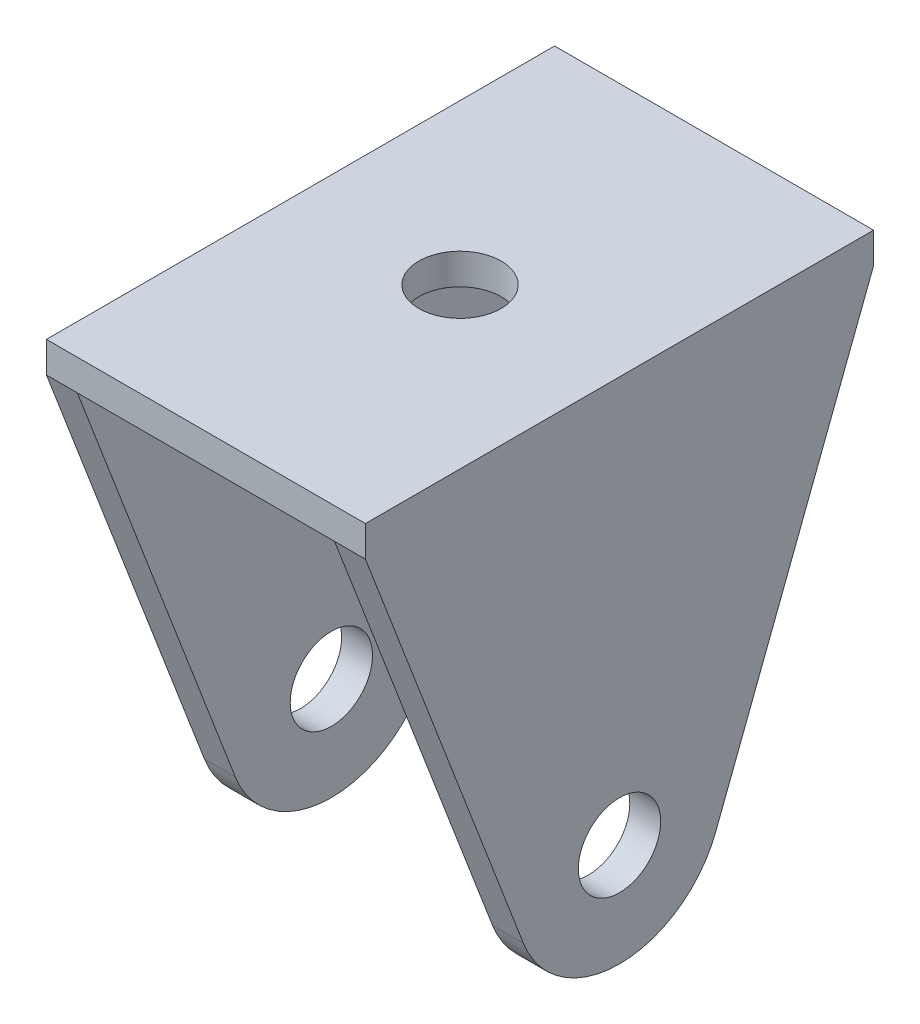
ISO-10303-21;
HEADER;
FILE_DESCRIPTION(('STEP AP214'),'2;1');
FILE_NAME('part.step','',(''),(''),'','','');
FILE_SCHEMA(('AUTOMOTIVE_DESIGN { 1 0 10303 214 1 1 1 1 }'));
ENDSEC;
DATA;
#1=APPLICATION_CONTEXT('core data for automotive mechanical design processes');
#2=APPLICATION_PROTOCOL_DEFINITION('international standard','automotive_design',2000,#1);
#3=PRODUCT_CONTEXT('',#1,'mechanical');
#4=PRODUCT('Part','Part','',(#3));
#5=PRODUCT_RELATED_PRODUCT_CATEGORY('part','',(#4));
#6=PRODUCT_DEFINITION_FORMATION('','',#4);
#7=PRODUCT_DEFINITION_CONTEXT('part definition',#1,'design');
#8=PRODUCT_DEFINITION('design','',#6,#7);
#9=PRODUCT_DEFINITION_SHAPE('','',#8);
#10=(LENGTH_UNIT() NAMED_UNIT(*) SI_UNIT(.MILLI.,.METRE.));
#11=(NAMED_UNIT(*) PLANE_ANGLE_UNIT() SI_UNIT($,.RADIAN.));
#12=(NAMED_UNIT(*) SI_UNIT($,.STERADIAN.) SOLID_ANGLE_UNIT());
#13=UNCERTAINTY_MEASURE_WITH_UNIT(LENGTH_MEASURE(1.E-05),#10,'distance_accuracy_value','');
#14=(GEOMETRIC_REPRESENTATION_CONTEXT(3) GLOBAL_UNCERTAINTY_ASSIGNED_CONTEXT((#13)) GLOBAL_UNIT_ASSIGNED_CONTEXT((#10,
#11,#12)) REPRESENTATION_CONTEXT('',''));
#15=CARTESIAN_POINT('',(0.,0.,0.));
#16=DIRECTION('',(0.,0.,1.));
#17=DIRECTION('',(1.,0.,0.));
#18=AXIS2_PLACEMENT_3D('',#15,#16,#17);
#19=CARTESIAN_POINT('',(0.,36.416320504547,0.));
#20=DIRECTION('',(0.,1.,0.));
#21=DIRECTION('',(0.,0.,1.));
#22=AXIS2_PLACEMENT_3D('',#19,#20,#21);
#23=PLANE('',#22);
#24=CARTESIAN_POINT('',(-12.5,36.416320504547,0.));
#25=DIRECTION('',(0.,1.,0.));
#26=DIRECTION('',(0.,0.,1.));
#27=AXIS2_PLACEMENT_3D('',#24,#25,#26);
#28=CIRCLE('',#27,4.);
#29=CARTESIAN_POINT('',(-12.5,36.416320504547,4.));
#30=VERTEX_POINT('',#29);
#31=EDGE_CURVE('E324',#30,#30,#28,.T.);
#32=ORIENTED_EDGE('',*,*,#31,.T.);
#33=EDGE_LOOP('',(#32));
#34=FACE_BOUND('',#33,.T.);
#35=DIRECTION('',(0.,0.,-1.));
#36=VECTOR('',#35,1.);
#37=CARTESIAN_POINT('',(-25.,36.416320504547,24.6903656663887));
#38=LINE('',#37,#36);
#39=CARTESIAN_POINT('',(-25.,36.416320504547,24.6903656663887));
#40=VERTEX_POINT('',#39);
#41=CARTESIAN_POINT('',(-25.,36.416320504547,-24.6903656663887));
#42=VERTEX_POINT('',#41);
#43=EDGE_CURVE('E302',#40,#42,#38,.T.);
#44=ORIENTED_EDGE('',*,*,#43,.T.);
#45=DIRECTION('',(-1.,0.,0.));
#46=VECTOR('',#45,1.);
#47=CARTESIAN_POINT('',(-28.,36.416320504547,-24.6903656663887));
#48=LINE('',#47,#46);
#49=CARTESIAN_POINT('',(0.,36.416320504547,-24.6903656663887));
#50=VERTEX_POINT('',#49);
#51=EDGE_CURVE('E174',#50,#42,#48,.T.);
#52=ORIENTED_EDGE('',*,*,#51,.F.);
#53=DIRECTION('',(0.,0.,1.));
#54=VECTOR('',#53,1.);
#55=CARTESIAN_POINT('',(0.,36.416320504547,24.6903656663887));
#56=LINE('',#55,#54);
#57=CARTESIAN_POINT('',(0.,36.416320504547,24.6903656663887));
#58=VERTEX_POINT('',#57);
#59=EDGE_CURVE('E222',#50,#58,#56,.T.);
#60=ORIENTED_EDGE('',*,*,#59,.T.);
#61=DIRECTION('',(1.,0.,0.));
#62=VECTOR('',#61,1.);
#63=CARTESIAN_POINT('',(-28.,36.416320504547,24.6903656663887));
#64=LINE('',#63,#62);
#65=EDGE_CURVE('E159',#40,#58,#64,.T.);
#66=ORIENTED_EDGE('',*,*,#65,.F.);
#67=EDGE_LOOP('',(#44,#52,#60,#66));
#68=FACE_BOUND('',#67,.T.);
#69=ADVANCED_FACE('F45',(#34,#68),#23,.F.);
#70=CARTESIAN_POINT('',(3.,0.,0.));
#71=DIRECTION('',(1.,0.,0.));
#72=DIRECTION('',(0.,0.,-1.));
#73=AXIS2_PLACEMENT_3D('',#70,#71,#72);
#74=PLANE('',#73);
#75=CARTESIAN_POINT('',(3.,0.,0.));
#76=DIRECTION('',(1.,0.,0.));
#77=DIRECTION('',(0.,0.,-1.));
#78=AXIS2_PLACEMENT_3D('',#75,#76,#77);
#79=CIRCLE('',#78,10.);
#80=CARTESIAN_POINT('',(3.,-3.58367949545302,9.33580426497202));
#81=VERTEX_POINT('',#80);
#82=CARTESIAN_POINT('',(3.,-3.58367949545302,-9.33580426497202));
#83=VERTEX_POINT('',#82);
#84=EDGE_CURVE('E209',#81,#83,#79,.T.);
#85=ORIENTED_EDGE('',*,*,#84,.T.);
#86=DIRECTION('',(0.,0.933580426497201,-0.358367949545301));
#87=VECTOR('',#86,1.);
#88=CARTESIAN_POINT('',(3.,36.416320504547,-24.6903656663887));
#89=LINE('',#88,#87);
#90=CARTESIAN_POINT('',(3.,36.416320504547,-24.6903656663887));
#91=VERTEX_POINT('',#90);
#92=EDGE_CURVE('E88',#83,#91,#89,.T.);
#93=ORIENTED_EDGE('',*,*,#92,.T.);
#94=DIRECTION('',(0.,-1.,0.));
#95=VECTOR('',#94,1.);
#96=CARTESIAN_POINT('',(3.,39.416320504547,-24.6903656663887));
#97=LINE('',#96,#95);
#98=CARTESIAN_POINT('',(3.,39.416320504547,-24.6903656663887));
#99=VERTEX_POINT('',#98);
#100=EDGE_CURVE('E190',#99,#91,#97,.T.);
#101=ORIENTED_EDGE('',*,*,#100,.F.);
#102=DIRECTION('',(0.,0.,-1.));
#103=VECTOR('',#102,1.);
#104=CARTESIAN_POINT('',(3.,39.416320504547,-24.6903656663887));
#105=LINE('',#104,#103);
#106=CARTESIAN_POINT('',(3.,39.416320504547,24.6903656663887));
#107=VERTEX_POINT('',#106);
#108=EDGE_CURVE('E177',#107,#99,#105,.T.);
#109=ORIENTED_EDGE('',*,*,#108,.F.);
#110=DIRECTION('',(0.,-1.,0.));
#111=VECTOR('',#110,1.);
#112=CARTESIAN_POINT('',(3.,39.416320504547,24.6903656663887));
#113=LINE('',#112,#111);
#114=CARTESIAN_POINT('',(3.,36.416320504547,24.6903656663887));
#115=VERTEX_POINT('',#114);
#116=EDGE_CURVE('E194',#107,#115,#113,.T.);
#117=ORIENTED_EDGE('',*,*,#116,.T.);
#118=DIRECTION('',(0.,-0.933580426497201,-0.358367949545301));
#119=VECTOR('',#118,1.);
#120=CARTESIAN_POINT('',(3.,-3.58367949545302,9.33580426497202));
#121=LINE('',#120,#119);
#122=EDGE_CURVE('E63',#115,#81,#121,.T.);
#123=ORIENTED_EDGE('',*,*,#122,.T.);
#124=EDGE_LOOP('',(#85,#93,#101,#109,#117,#123));
#125=FACE_BOUND('',#124,.T.);
#126=CARTESIAN_POINT('',(3.,0.,0.));
#127=DIRECTION('',(1.,0.,0.));
#128=DIRECTION('',(0.,0.,-1.));
#129=AXIS2_PLACEMENT_3D('',#126,#127,#128);
#130=CIRCLE('',#129,4.);
#131=CARTESIAN_POINT('',(3.,0.,-4.));
#132=VERTEX_POINT('',#131);
#133=EDGE_CURVE('E201',#132,#132,#130,.T.);
#134=ORIENTED_EDGE('',*,*,#133,.F.);
#135=EDGE_LOOP('',(#134));
#136=FACE_BOUND('',#135,.T.);
#137=ADVANCED_FACE('F252',(#125,#136),#74,.T.);
#138=CARTESIAN_POINT('',(0.,0.,0.));
#139=DIRECTION('',(1.,0.,0.));
#140=DIRECTION('',(0.,0.,-1.));
#141=AXIS2_PLACEMENT_3D('',#138,#139,#140);
#142=PLANE('',#141);
#143=CARTESIAN_POINT('',(0.,0.,0.));
#144=DIRECTION('',(1.,0.,0.));
#145=DIRECTION('',(0.,0.,-1.));
#146=AXIS2_PLACEMENT_3D('',#143,#144,#145);
#147=CIRCLE('',#146,10.);
#148=CARTESIAN_POINT('',(0.,-3.58367949545302,9.33580426497202));
#149=VERTEX_POINT('',#148);
#150=CARTESIAN_POINT('',(0.,-3.58367949545302,-9.33580426497202));
#151=VERTEX_POINT('',#150);
#152=EDGE_CURVE('E205',#149,#151,#147,.T.);
#153=ORIENTED_EDGE('',*,*,#152,.F.);
#154=DIRECTION('',(0.,-0.933580426497201,-0.358367949545301));
#155=VECTOR('',#154,1.);
#156=CARTESIAN_POINT('',(0.,-3.58367949545302,9.33580426497202));
#157=LINE('',#156,#155);
#158=EDGE_CURVE('E83',#58,#149,#157,.T.);
#159=ORIENTED_EDGE('',*,*,#158,.F.);
#160=ORIENTED_EDGE('',*,*,#59,.F.);
#161=DIRECTION('',(0.,0.933580426497201,-0.358367949545301));
#162=VECTOR('',#161,1.);
#163=CARTESIAN_POINT('',(0.,36.416320504547,-24.6903656663887));
#164=LINE('',#163,#162);
#165=EDGE_CURVE('E76',#151,#50,#164,.T.);
#166=ORIENTED_EDGE('',*,*,#165,.F.);
#167=EDGE_LOOP('',(#153,#159,#160,#166));
#168=FACE_BOUND('',#167,.T.);
#169=CARTESIAN_POINT('',(0.,0.,0.));
#170=DIRECTION('',(1.,0.,0.));
#171=DIRECTION('',(0.,0.,-1.));
#172=AXIS2_PLACEMENT_3D('',#169,#170,#171);
#173=CIRCLE('',#172,4.);
#174=CARTESIAN_POINT('',(0.,0.,-4.));
#175=VERTEX_POINT('',#174);
#176=EDGE_CURVE('E200',#175,#175,#173,.T.);
#177=ORIENTED_EDGE('',*,*,#176,.T.);
#178=EDGE_LOOP('',(#177));
#179=FACE_BOUND('',#178,.T.);
#180=ADVANCED_FACE('F249',(#168,#179),#142,.F.);
#181=CARTESIAN_POINT('',(3.,0.,0.));
#182=DIRECTION('',(-1.,0.,0.));
#183=DIRECTION('',(0.,0.,1.));
#184=AXIS2_PLACEMENT_3D('',#181,#182,#183);
#185=CYLINDRICAL_SURFACE('',#184,10.);
#186=ORIENTED_EDGE('',*,*,#152,.T.);
#187=DIRECTION('',(-1.,0.,0.));
#188=VECTOR('',#187,1.);
#189=CARTESIAN_POINT('',(3.,-3.58367949545302,-9.33580426497202));
#190=LINE('',#189,#188);
#191=EDGE_CURVE('E11',#83,#151,#190,.T.);
#192=ORIENTED_EDGE('',*,*,#191,.F.);
#193=ORIENTED_EDGE('',*,*,#84,.F.);
#194=DIRECTION('',(-1.,0.,0.));
#195=VECTOR('',#194,1.);
#196=CARTESIAN_POINT('',(3.,-3.58367949545302,9.33580426497202));
#197=LINE('',#196,#195);
#198=EDGE_CURVE('E216',#81,#149,#197,.T.);
#199=ORIENTED_EDGE('',*,*,#198,.T.);
#200=EDGE_LOOP('',(#186,#192,#193,#199));
#201=FACE_BOUND('',#200,.T.);
#202=ADVANCED_FACE('F47',(#201),#185,.T.);
#203=CARTESIAN_POINT('',(3.,36.416320504547,-24.6903656663887));
#204=DIRECTION('',(0.,0.358367949545301,0.933580426497201));
#205=DIRECTION('',(0.,-0.933580426497201,0.358367949545301));
#206=AXIS2_PLACEMENT_3D('',#203,#204,#205);
#207=PLANE('',#206);
#208=ORIENTED_EDGE('',*,*,#165,.T.);
#209=DIRECTION('',(-1.,0.,0.));
#210=VECTOR('',#209,1.);
#211=CARTESIAN_POINT('',(3.,36.416320504547,-24.6903656663887));
#212=LINE('',#211,#210);
#213=EDGE_CURVE('E55',#91,#50,#212,.T.);
#214=ORIENTED_EDGE('',*,*,#213,.F.);
#215=ORIENTED_EDGE('',*,*,#92,.F.);
#216=ORIENTED_EDGE('',*,*,#191,.T.);
#217=EDGE_LOOP('',(#208,#214,#215,#216));
#218=FACE_BOUND('',#217,.T.);
#219=ADVANCED_FACE('F240',(#218),#207,.F.);
#220=CARTESIAN_POINT('',(3.,-3.58367949545302,9.33580426497202));
#221=DIRECTION('',(0.,0.358367949545301,-0.933580426497201));
#222=DIRECTION('',(0.,0.933580426497201,0.358367949545301));
#223=AXIS2_PLACEMENT_3D('',#220,#221,#222);
#224=PLANE('',#223);
#225=ORIENTED_EDGE('',*,*,#158,.T.);
#226=ORIENTED_EDGE('',*,*,#198,.F.);
#227=ORIENTED_EDGE('',*,*,#122,.F.);
#228=DIRECTION('',(-1.,0.,0.));
#229=VECTOR('',#228,1.);
#230=CARTESIAN_POINT('',(3.,36.416320504547,24.6903656663887));
#231=LINE('',#230,#229);
#232=EDGE_CURVE('E230',#115,#58,#231,.T.);
#233=ORIENTED_EDGE('',*,*,#232,.T.);
#234=EDGE_LOOP('',(#225,#226,#227,#233));
#235=FACE_BOUND('',#234,.T.);
#236=ADVANCED_FACE('F242',(#235),#224,.F.);
#237=CARTESIAN_POINT('',(3.,0.,0.));
#238=DIRECTION('',(-1.,0.,0.));
#239=DIRECTION('',(0.,0.,1.));
#240=AXIS2_PLACEMENT_3D('',#237,#238,#239);
#241=CYLINDRICAL_SURFACE('',#240,4.);
#242=ORIENTED_EDGE('',*,*,#133,.T.);
#243=EDGE_LOOP('',(#242));
#244=FACE_BOUND('',#243,.T.);
#245=ORIENTED_EDGE('',*,*,#176,.F.);
#246=EDGE_LOOP('',(#245));
#247=FACE_BOUND('',#246,.T.);
#248=ADVANCED_FACE('F247',(#244,#247),#241,.F.);
#249=CARTESIAN_POINT('',(-28.,39.416320504547,-24.6903656663887));
#250=DIRECTION('',(1.,0.,0.));
#251=DIRECTION('',(0.,0.,-1.));
#252=AXIS2_PLACEMENT_3D('',#249,#250,#251);
#253=PLANE('',#252);
#254=DIRECTION('',(0.,-1.,0.));
#255=VECTOR('',#254,1.);
#256=CARTESIAN_POINT('',(-28.,39.416320504547,-24.6903656663887));
#257=LINE('',#256,#255);
#258=CARTESIAN_POINT('',(-28.,39.416320504547,-24.6903656663887));
#259=VERTEX_POINT('',#258);
#260=CARTESIAN_POINT('',(-28.,36.416320504547,-24.6903656663887));
#261=VERTEX_POINT('',#260);
#262=EDGE_CURVE('E182',#259,#261,#257,.T.);
#263=ORIENTED_EDGE('',*,*,#262,.T.);
#264=DIRECTION('',(0.,-0.933580426497201,0.358367949545301));
#265=VECTOR('',#264,1.);
#266=CARTESIAN_POINT('',(-28.,36.416320504547,-24.6903656663887));
#267=LINE('',#266,#265);
#268=CARTESIAN_POINT('',(-28.,-3.58367949545301,-9.33580426497202));
#269=VERTEX_POINT('',#268);
#270=EDGE_CURVE('E142',#261,#269,#267,.T.);
#271=ORIENTED_EDGE('',*,*,#270,.T.);
#272=CARTESIAN_POINT('',(-28.,0.,0.));
#273=DIRECTION('',(-1.,0.,0.));
#274=DIRECTION('',(0.,0.,1.));
#275=AXIS2_PLACEMENT_3D('',#272,#273,#274);
#276=CIRCLE('',#275,10.);
#277=CARTESIAN_POINT('',(-28.,-3.58367949545302,9.33580426497201));
#278=VERTEX_POINT('',#277);
#279=EDGE_CURVE('E143',#269,#278,#276,.T.);
#280=ORIENTED_EDGE('',*,*,#279,.T.);
#281=DIRECTION('',(0.,0.933580426497201,0.358367949545301));
#282=VECTOR('',#281,1.);
#283=CARTESIAN_POINT('',(-28.,-3.58367949545302,9.33580426497201));
#284=LINE('',#283,#282);
#285=CARTESIAN_POINT('',(-28.,36.416320504547,24.6903656663887));
#286=VERTEX_POINT('',#285);
#287=EDGE_CURVE('E130',#278,#286,#284,.T.);
#288=ORIENTED_EDGE('',*,*,#287,.T.);
#289=DIRECTION('',(0.,-1.,0.));
#290=VECTOR('',#289,1.);
#291=CARTESIAN_POINT('',(-28.,39.416320504547,24.6903656663887));
#292=LINE('',#291,#290);
#293=CARTESIAN_POINT('',(-28.,39.416320504547,24.6903656663887));
#294=VERTEX_POINT('',#293);
#295=EDGE_CURVE('E197',#294,#286,#292,.T.);
#296=ORIENTED_EDGE('',*,*,#295,.F.);
#297=DIRECTION('',(0.,0.,1.));
#298=VECTOR('',#297,1.);
#299=CARTESIAN_POINT('',(-28.,39.416320504547,-24.6903656663887));
#300=LINE('',#299,#298);
#301=EDGE_CURVE('E169',#259,#294,#300,.T.);
#302=ORIENTED_EDGE('',*,*,#301,.F.);
#303=EDGE_LOOP('',(#263,#271,#280,#288,#296,#302));
#304=FACE_BOUND('',#303,.T.);
#305=CARTESIAN_POINT('',(-28.,0.,0.));
#306=DIRECTION('',(-1.,0.,0.));
#307=DIRECTION('',(0.,0.,1.));
#308=AXIS2_PLACEMENT_3D('',#305,#306,#307);
#309=CIRCLE('',#308,4.);
#310=CARTESIAN_POINT('',(-28.,0.,4.));
#311=VERTEX_POINT('',#310);
#312=EDGE_CURVE('E315',#311,#311,#309,.T.);
#313=ORIENTED_EDGE('',*,*,#312,.F.);
#314=EDGE_LOOP('',(#313));
#315=FACE_BOUND('',#314,.T.);
#316=ADVANCED_FACE('F147',(#304,#315),#253,.F.);
#317=CARTESIAN_POINT('',(-28.,39.416320504547,24.6903656663887));
#318=DIRECTION('',(0.,0.,-1.));
#319=DIRECTION('',(-1.,0.,0.));
#320=AXIS2_PLACEMENT_3D('',#317,#318,#319);
#321=PLANE('',#320);
#322=EDGE_CURVE('E137',#286,#40,#64,.T.);
#323=ORIENTED_EDGE('',*,*,#322,.T.);
#324=ORIENTED_EDGE('',*,*,#65,.T.);
#325=ORIENTED_EDGE('',*,*,#232,.F.);
#326=ORIENTED_EDGE('',*,*,#116,.F.);
#327=DIRECTION('',(1.,0.,0.));
#328=VECTOR('',#327,1.);
#329=CARTESIAN_POINT('',(-28.,39.416320504547,24.6903656663887));
#330=LINE('',#329,#328);
#331=EDGE_CURVE('E173',#294,#107,#330,.T.);
#332=ORIENTED_EDGE('',*,*,#331,.F.);
#333=ORIENTED_EDGE('',*,*,#295,.T.);
#334=EDGE_LOOP('',(#323,#324,#325,#326,#332,#333));
#335=FACE_BOUND('',#334,.T.);
#336=ADVANCED_FACE('F267',(#335),#321,.F.);
#337=CARTESIAN_POINT('',(-28.,39.416320504547,-24.6903656663887));
#338=DIRECTION('',(0.,0.,1.));
#339=DIRECTION('',(1.,0.,0.));
#340=AXIS2_PLACEMENT_3D('',#337,#338,#339);
#341=PLANE('',#340);
#342=ORIENTED_EDGE('',*,*,#213,.T.);
#343=ORIENTED_EDGE('',*,*,#51,.T.);
#344=DIRECTION('',(1.,0.,0.));
#345=VECTOR('',#344,1.);
#346=CARTESIAN_POINT('',(-28.,36.416320504547,-24.6903656663887));
#347=LINE('',#346,#345);
#348=EDGE_CURVE('E160',#261,#42,#347,.T.);
#349=ORIENTED_EDGE('',*,*,#348,.F.);
#350=ORIENTED_EDGE('',*,*,#262,.F.);
#351=DIRECTION('',(-1.,0.,0.));
#352=VECTOR('',#351,1.);
#353=CARTESIAN_POINT('',(-28.,39.416320504547,-24.6903656663887));
#354=LINE('',#353,#352);
#355=EDGE_CURVE('E180',#99,#259,#354,.T.);
#356=ORIENTED_EDGE('',*,*,#355,.F.);
#357=ORIENTED_EDGE('',*,*,#100,.T.);
#358=EDGE_LOOP('',(#342,#343,#349,#350,#356,#357));
#359=FACE_BOUND('',#358,.T.);
#360=ADVANCED_FACE('F235',(#359),#341,.F.);
#361=CARTESIAN_POINT('',(0.,39.416320504547,0.));
#362=DIRECTION('',(0.,1.,0.));
#363=DIRECTION('',(0.,0.,1.));
#364=AXIS2_PLACEMENT_3D('',#361,#362,#363);
#365=PLANE('',#364);
#366=CARTESIAN_POINT('',(-12.5,39.416320504547,0.));
#367=DIRECTION('',(0.,1.,0.));
#368=DIRECTION('',(0.,0.,1.));
#369=AXIS2_PLACEMENT_3D('',#366,#367,#368);
#370=CIRCLE('',#369,4.);
#371=CARTESIAN_POINT('',(-12.5,39.416320504547,4.));
#372=VERTEX_POINT('',#371);
#373=EDGE_CURVE('E327',#372,#372,#370,.T.);
#374=ORIENTED_EDGE('',*,*,#373,.F.);
#375=EDGE_LOOP('',(#374));
#376=FACE_BOUND('',#375,.T.);
#377=ORIENTED_EDGE('',*,*,#301,.T.);
#378=ORIENTED_EDGE('',*,*,#331,.T.);
#379=ORIENTED_EDGE('',*,*,#108,.T.);
#380=ORIENTED_EDGE('',*,*,#355,.T.);
#381=EDGE_LOOP('',(#377,#378,#379,#380));
#382=FACE_BOUND('',#381,.T.);
#383=ADVANCED_FACE('F263',(#376,#382),#365,.T.);
#384=CARTESIAN_POINT('',(-25.,0.,0.));
#385=DIRECTION('',(-1.,0.,0.));
#386=DIRECTION('',(0.,0.,1.));
#387=AXIS2_PLACEMENT_3D('',#384,#385,#386);
#388=PLANE('',#387);
#389=CARTESIAN_POINT('',(-25.,0.,0.));
#390=DIRECTION('',(-1.,0.,0.));
#391=DIRECTION('',(0.,0.,1.));
#392=AXIS2_PLACEMENT_3D('',#389,#390,#391);
#393=CIRCLE('',#392,10.);
#394=CARTESIAN_POINT('',(-25.,-3.58367949545301,-9.33580426497202));
#395=VERTEX_POINT('',#394);
#396=CARTESIAN_POINT('',(-25.,-3.58367949545302,9.33580426497201));
#397=VERTEX_POINT('',#396);
#398=EDGE_CURVE('E157',#395,#397,#393,.T.);
#399=ORIENTED_EDGE('',*,*,#398,.F.);
#400=DIRECTION('',(0.,-0.933580426497201,0.358367949545301));
#401=VECTOR('',#400,1.);
#402=CARTESIAN_POINT('',(-25.,36.416320504547,-24.6903656663887));
#403=LINE('',#402,#401);
#404=EDGE_CURVE('E153',#42,#395,#403,.T.);
#405=ORIENTED_EDGE('',*,*,#404,.F.);
#406=ORIENTED_EDGE('',*,*,#43,.F.);
#407=DIRECTION('',(0.,0.933580426497201,0.358367949545301));
#408=VECTOR('',#407,1.);
#409=CARTESIAN_POINT('',(-25.,-3.58367949545302,9.33580426497201));
#410=LINE('',#409,#408);
#411=EDGE_CURVE('E306',#397,#40,#410,.T.);
#412=ORIENTED_EDGE('',*,*,#411,.F.);
#413=EDGE_LOOP('',(#399,#405,#406,#412));
#414=FACE_BOUND('',#413,.T.);
#415=CARTESIAN_POINT('',(-25.,0.,0.));
#416=DIRECTION('',(-1.,0.,0.));
#417=DIRECTION('',(0.,0.,1.));
#418=AXIS2_PLACEMENT_3D('',#415,#416,#417);
#419=CIRCLE('',#418,4.);
#420=CARTESIAN_POINT('',(-25.,0.,4.));
#421=VERTEX_POINT('',#420);
#422=EDGE_CURVE('E318',#421,#421,#419,.T.);
#423=ORIENTED_EDGE('',*,*,#422,.T.);
#424=EDGE_LOOP('',(#423));
#425=FACE_BOUND('',#424,.T.);
#426=ADVANCED_FACE('F300',(#414,#425),#388,.F.);
#427=CARTESIAN_POINT('',(-28.,0.,0.));
#428=DIRECTION('',(1.,0.,0.));
#429=DIRECTION('',(0.,0.,-1.));
#430=AXIS2_PLACEMENT_3D('',#427,#428,#429);
#431=CYLINDRICAL_SURFACE('',#430,10.);
#432=ORIENTED_EDGE('',*,*,#398,.T.);
#433=DIRECTION('',(1.,0.,0.));
#434=VECTOR('',#433,1.);
#435=CARTESIAN_POINT('',(-28.,-3.58367949545302,9.33580426497201));
#436=LINE('',#435,#434);
#437=EDGE_CURVE('E134',#278,#397,#436,.T.);
#438=ORIENTED_EDGE('',*,*,#437,.F.);
#439=ORIENTED_EDGE('',*,*,#279,.F.);
#440=DIRECTION('',(1.,0.,0.));
#441=VECTOR('',#440,1.);
#442=CARTESIAN_POINT('',(-28.,-3.58367949545301,-9.33580426497202));
#443=LINE('',#442,#441);
#444=EDGE_CURVE('E165',#269,#395,#443,.T.);
#445=ORIENTED_EDGE('',*,*,#444,.T.);
#446=EDGE_LOOP('',(#432,#438,#439,#445));
#447=FACE_BOUND('',#446,.T.);
#448=ADVANCED_FACE('F155',(#447),#431,.T.);
#449=CARTESIAN_POINT('',(-28.,-3.58367949545302,9.33580426497201));
#450=DIRECTION('',(0.,0.358367949545301,-0.933580426497201));
#451=DIRECTION('',(0.,0.933580426497201,0.358367949545301));
#452=AXIS2_PLACEMENT_3D('',#449,#450,#451);
#453=PLANE('',#452);
#454=ORIENTED_EDGE('',*,*,#411,.T.);
#455=ORIENTED_EDGE('',*,*,#322,.F.);
#456=ORIENTED_EDGE('',*,*,#287,.F.);
#457=ORIENTED_EDGE('',*,*,#437,.T.);
#458=EDGE_LOOP('',(#454,#455,#456,#457));
#459=FACE_BOUND('',#458,.T.);
#460=ADVANCED_FACE('F132',(#459),#453,.F.);
#461=CARTESIAN_POINT('',(-28.,36.416320504547,-24.6903656663887));
#462=DIRECTION('',(0.,0.358367949545301,0.933580426497201));
#463=DIRECTION('',(0.,-0.933580426497201,0.358367949545301));
#464=AXIS2_PLACEMENT_3D('',#461,#462,#463);
#465=PLANE('',#464);
#466=ORIENTED_EDGE('',*,*,#404,.T.);
#467=ORIENTED_EDGE('',*,*,#444,.F.);
#468=ORIENTED_EDGE('',*,*,#270,.F.);
#469=ORIENTED_EDGE('',*,*,#348,.T.);
#470=EDGE_LOOP('',(#466,#467,#468,#469));
#471=FACE_BOUND('',#470,.T.);
#472=ADVANCED_FACE('F296',(#471),#465,.F.);
#473=CARTESIAN_POINT('',(-28.,0.,0.));
#474=DIRECTION('',(1.,0.,0.));
#475=DIRECTION('',(0.,0.,-1.));
#476=AXIS2_PLACEMENT_3D('',#473,#474,#475);
#477=CYLINDRICAL_SURFACE('',#476,4.);
#478=ORIENTED_EDGE('',*,*,#312,.T.);
#479=EDGE_LOOP('',(#478));
#480=FACE_BOUND('',#479,.T.);
#481=ORIENTED_EDGE('',*,*,#422,.F.);
#482=EDGE_LOOP('',(#481));
#483=FACE_BOUND('',#482,.T.);
#484=ADVANCED_FACE('F337',(#480,#483),#477,.F.);
#485=CARTESIAN_POINT('',(-12.5,36.416320504547,0.));
#486=DIRECTION('',(0.,1.,0.));
#487=DIRECTION('',(0.,0.,1.));
#488=AXIS2_PLACEMENT_3D('',#485,#486,#487);
#489=CYLINDRICAL_SURFACE('',#488,4.);
#490=ORIENTED_EDGE('',*,*,#31,.F.);
#491=EDGE_LOOP('',(#490));
#492=FACE_BOUND('',#491,.T.);
#493=ORIENTED_EDGE('',*,*,#373,.T.);
#494=EDGE_LOOP('',(#493));
#495=FACE_BOUND('',#494,.T.);
#496=ADVANCED_FACE('F334',(#492,#495),#489,.F.);
#497=CLOSED_SHELL('',(#69,#137,#180,#202,#219,#236,#248,#316,#336,#360,#383,#426,#448,#460,#472,
#484,#496));
#498=MANIFOLD_SOLID_BREP('B2',#497);
#499=ADVANCED_BREP_SHAPE_REPRESENTATION('',(#18,#498),#14);
#500=SHAPE_DEFINITION_REPRESENTATION(#9,#499);
ENDSEC;
END-ISO-10303-21;
